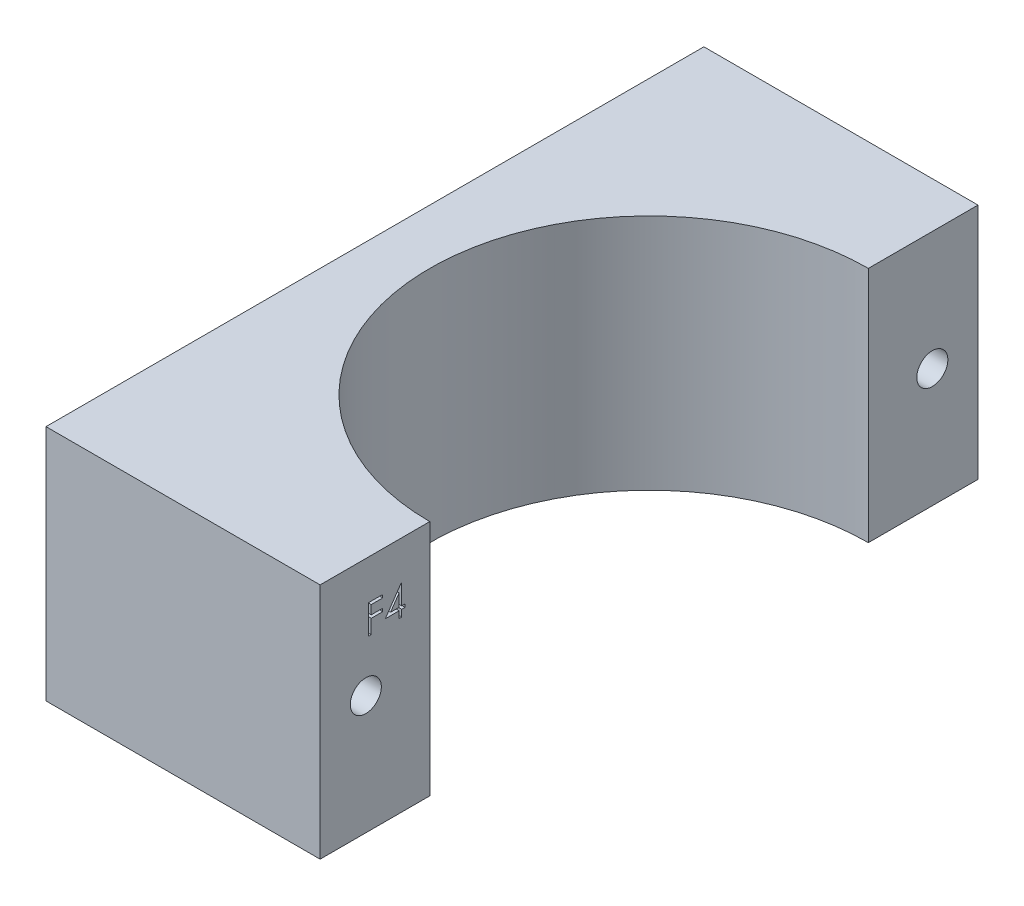
ISO-10303-21;
HEADER;
FILE_DESCRIPTION(('STEP AP214'),'2;1');
FILE_NAME('part.step','',(''),(''),'','','');
FILE_SCHEMA(('AUTOMOTIVE_DESIGN { 1 0 10303 214 1 1 1 1 }'));
ENDSEC;
DATA;
#1=APPLICATION_CONTEXT('core data for automotive mechanical design processes');
#2=APPLICATION_PROTOCOL_DEFINITION('international standard','automotive_design',2000,#1);
#3=PRODUCT_CONTEXT('',#1,'mechanical');
#4=PRODUCT('Part','Part','',(#3));
#5=PRODUCT_RELATED_PRODUCT_CATEGORY('part','',(#4));
#6=PRODUCT_DEFINITION_FORMATION('','',#4);
#7=PRODUCT_DEFINITION_CONTEXT('part definition',#1,'design');
#8=PRODUCT_DEFINITION('design','',#6,#7);
#9=PRODUCT_DEFINITION_SHAPE('','',#8);
#10=(LENGTH_UNIT() NAMED_UNIT(*) SI_UNIT(.MILLI.,.METRE.));
#11=(NAMED_UNIT(*) PLANE_ANGLE_UNIT() SI_UNIT($,.RADIAN.));
#12=(NAMED_UNIT(*) SI_UNIT($,.STERADIAN.) SOLID_ANGLE_UNIT());
#13=UNCERTAINTY_MEASURE_WITH_UNIT(LENGTH_MEASURE(1.E-05),#10,'distance_accuracy_value','');
#14=(GEOMETRIC_REPRESENTATION_CONTEXT(3) GLOBAL_UNCERTAINTY_ASSIGNED_CONTEXT((#13)) GLOBAL_UNIT_ASSIGNED_CONTEXT((#10,
#11,#12)) REPRESENTATION_CONTEXT('',''));
#15=CARTESIAN_POINT('',(0.,0.,0.));
#16=DIRECTION('',(0.,0.,1.));
#17=DIRECTION('',(1.,0.,0.));
#18=AXIS2_PLACEMENT_3D('',#15,#16,#17);
#19=CARTESIAN_POINT('',(-16.9982753010088,26.,39.4714285714286));
#20=DIRECTION('',(-1.,0.,0.));
#21=DIRECTION('',(0.,0.,1.));
#22=AXIS2_PLACEMENT_3D('',#19,#20,#21);
#23=PLANE('',#22);
#24=DIRECTION('',(0.,0.824332768950696,-0.566105543193209));
#25=VECTOR('',#24,1.);
#26=CARTESIAN_POINT('',(-16.9982753010088,19.2225018030725,32.3325004085675));
#27=LINE('',#26,#25);
#28=CARTESIAN_POINT('',(-16.9982753010088,19.2225018030725,32.3325004085675));
#29=VERTEX_POINT('',#28);
#30=CARTESIAN_POINT('',(-16.9982753010088,21.7462197517905,30.5993523717085));
#31=VERTEX_POINT('',#30);
#32=EDGE_CURVE('E67',#29,#31,#27,.T.);
#33=ORIENTED_EDGE('',*,*,#32,.T.);
#34=DIRECTION('',(0.,0.,-1.));
#35=VECTOR('',#34,1.);
#36=CARTESIAN_POINT('',(-16.9982753010088,21.7462197517905,30.5993523717085));
#37=LINE('',#36,#35);
#38=CARTESIAN_POINT('',(-16.9982753010088,21.7462197517905,30.5414747675419));
#39=VERTEX_POINT('',#38);
#40=EDGE_CURVE('E337',#31,#39,#37,.T.);
#41=ORIENTED_EDGE('',*,*,#40,.T.);
#42=DIRECTION('',(0.,-1.,0.));
#43=VECTOR('',#42,1.);
#44=CARTESIAN_POINT('',(-16.9982753010088,21.7462197517905,30.5414747675419));
#45=LINE('',#44,#43);
#46=CARTESIAN_POINT('',(-16.9982753010088,19.5481428287135,30.5414747675419));
#47=VERTEX_POINT('',#46);
#48=EDGE_CURVE('E333',#39,#47,#45,.T.);
#49=ORIENTED_EDGE('',*,*,#48,.T.);
#50=DIRECTION('',(0.,0.,-1.));
#51=VECTOR('',#50,1.);
#52=CARTESIAN_POINT('',(-16.9982753010088,19.5481428287135,30.5414747675419));
#53=LINE('',#52,#51);
#54=CARTESIAN_POINT('',(-16.9982753010088,19.5481428287135,30.1751286136957));
#55=VERTEX_POINT('',#54);
#56=EDGE_CURVE('E329',#47,#55,#53,.T.);
#57=ORIENTED_EDGE('',*,*,#56,.T.);
#58=DIRECTION('',(0.,-1.,0.));
#59=VECTOR('',#58,1.);
#60=CARTESIAN_POINT('',(-16.9982753010088,19.5481428287135,30.1751286136957));
#61=LINE('',#60,#59);
#62=CARTESIAN_POINT('',(-16.9982753010088,19.2225018030725,30.1751286136957));
#63=VERTEX_POINT('',#62);
#64=EDGE_CURVE('E325',#55,#63,#61,.T.);
#65=ORIENTED_EDGE('',*,*,#64,.T.);
#66=DIRECTION('',(0.,0.,1.));
#67=VECTOR('',#66,1.);
#68=CARTESIAN_POINT('',(-16.9982753010088,19.2225018030725,30.1751286136957));
#69=LINE('',#68,#67);
#70=CARTESIAN_POINT('',(-16.9982753010088,19.2225018030725,30.5414747675419));
#71=VERTEX_POINT('',#70);
#72=EDGE_CURVE('E321',#63,#71,#69,.T.);
#73=ORIENTED_EDGE('',*,*,#72,.T.);
#74=DIRECTION('',(0.,-1.,0.));
#75=VECTOR('',#74,1.);
#76=CARTESIAN_POINT('',(-16.9982753010088,19.2225018030725,30.5414747675419));
#77=LINE('',#76,#75);
#78=CARTESIAN_POINT('',(-16.9982753010088,18.4898094953802,30.5414747675419));
#79=VERTEX_POINT('',#78);
#80=EDGE_CURVE('E317',#71,#79,#77,.T.);
#81=ORIENTED_EDGE('',*,*,#80,.T.);
#82=DIRECTION('',(0.,0.,1.));
#83=VECTOR('',#82,1.);
#84=CARTESIAN_POINT('',(-16.9982753010088,18.4898094953802,30.5414747675419));
#85=LINE('',#84,#83);
#86=CARTESIAN_POINT('',(-16.9982753010088,18.4898094953802,30.8264106649778));
#87=VERTEX_POINT('',#86);
#88=EDGE_CURVE('E313',#79,#87,#85,.T.);
#89=ORIENTED_EDGE('',*,*,#88,.T.);
#90=DIRECTION('',(0.,1.,0.));
#91=VECTOR('',#90,1.);
#92=CARTESIAN_POINT('',(-16.9982753010088,18.4898094953802,30.8264106649778));
#93=LINE('',#92,#91);
#94=CARTESIAN_POINT('',(-16.9982753010088,19.2225018030725,30.8264106649778));
#95=VERTEX_POINT('',#94);
#96=EDGE_CURVE('E308',#87,#95,#93,.T.);
#97=ORIENTED_EDGE('',*,*,#96,.T.);
#98=DIRECTION('',(0.,0.,1.));
#99=VECTOR('',#98,1.);
#100=CARTESIAN_POINT('',(-16.9982753010088,19.2225018030725,30.8264106649778));
#101=LINE('',#100,#99);
#102=EDGE_CURVE('E304',#95,#29,#101,.T.);
#103=ORIENTED_EDGE('',*,*,#102,.T.);
#104=EDGE_LOOP('',(#33,#41,#49,#57,#65,#73,#81,#89,#97,#103));
#105=FACE_BOUND('',#104,.T.);
#106=CARTESIAN_POINT('',(-16.9982753010088,13.,34.4714285714286));
#107=DIRECTION('',(1.,0.,0.));
#108=DIRECTION('',(0.,0.,-1.));
#109=AXIS2_PLACEMENT_3D('',#106,#107,#108);
#110=CIRCLE('',#109,1.7);
#111=CARTESIAN_POINT('',(-16.9982753010088,13.,32.7714285714286));
#112=VERTEX_POINT('',#111);
#113=EDGE_CURVE('E411',#112,#112,#110,.T.);
#114=ORIENTED_EDGE('',*,*,#113,.F.);
#115=EDGE_LOOP('',(#114));
#116=FACE_BOUND('',#115,.T.);
#117=DIRECTION('',(0.,0.,-1.));
#118=VECTOR('',#117,1.);
#119=CARTESIAN_POINT('',(-16.9982753010088,0.,39.4714285714286));
#120=LINE('',#119,#118);
#121=CARTESIAN_POINT('',(-16.9982753010088,0.,39.4714285714286));
#122=VERTEX_POINT('',#121);
#123=CARTESIAN_POINT('',(-16.9982753010088,0.,27.4714285714286));
#124=VERTEX_POINT('',#123);
#125=EDGE_CURVE('E448',#122,#124,#120,.T.);
#126=ORIENTED_EDGE('',*,*,#125,.T.);
#127=DIRECTION('',(0.,-1.,0.));
#128=VECTOR('',#127,1.);
#129=CARTESIAN_POINT('',(-16.9982753010088,26.,27.4714285714286));
#130=LINE('',#129,#128);
#131=CARTESIAN_POINT('',(-16.9982753010088,26.,27.4714285714286));
#132=VERTEX_POINT('',#131);
#133=EDGE_CURVE('E463',#132,#124,#130,.T.);
#134=ORIENTED_EDGE('',*,*,#133,.F.);
#135=DIRECTION('',(0.,0.,-1.));
#136=VECTOR('',#135,1.);
#137=CARTESIAN_POINT('',(-16.9982753010088,26.,39.4714285714286));
#138=LINE('',#137,#136);
#139=CARTESIAN_POINT('',(-16.9982753010088,26.,39.4714285714286));
#140=VERTEX_POINT('',#139);
#141=EDGE_CURVE('E429',#140,#132,#138,.T.);
#142=ORIENTED_EDGE('',*,*,#141,.F.);
#143=DIRECTION('',(0.,-1.,0.));
#144=VECTOR('',#143,1.);
#145=CARTESIAN_POINT('',(-16.9982753010088,26.,39.4714285714286));
#146=LINE('',#145,#144);
#147=EDGE_CURVE('E467',#140,#122,#146,.T.);
#148=ORIENTED_EDGE('',*,*,#147,.T.);
#149=EDGE_LOOP('',(#126,#134,#142,#148));
#150=FACE_BOUND('',#149,.T.);
#151=DIRECTION('',(0.,1.,0.));
#152=VECTOR('',#151,1.);
#153=CARTESIAN_POINT('',(-16.9982753010088,18.4898094953802,34.1642311777983));
#154=LINE('',#153,#152);
#155=CARTESIAN_POINT('',(-16.9982753010088,18.4898094953802,34.1642311777983));
#156=VERTEX_POINT('',#155);
#157=CARTESIAN_POINT('',(-16.9982753010088,21.6648094953802,34.1642311777983));
#158=VERTEX_POINT('',#157);
#159=EDGE_CURVE('E59',#156,#158,#154,.T.);
#160=ORIENTED_EDGE('',*,*,#159,.T.);
#161=DIRECTION('',(0.,0.,-1.));
#162=VECTOR('',#161,1.);
#163=CARTESIAN_POINT('',(-16.9982753010088,21.6648094953802,34.1642311777983));
#164=LINE('',#163,#162);
#165=CARTESIAN_POINT('',(-16.9982753010088,21.6648094953802,32.6174363060034));
#166=VERTEX_POINT('',#165);
#167=EDGE_CURVE('E259',#158,#166,#164,.T.);
#168=ORIENTED_EDGE('',*,*,#167,.T.);
#169=DIRECTION('',(0.,-1.,0.));
#170=VECTOR('',#169,1.);
#171=CARTESIAN_POINT('',(-16.9982753010088,21.6648094953802,32.6174363060034));
#172=LINE('',#171,#170);
#173=CARTESIAN_POINT('',(-16.9982753010088,21.3391684697392,32.6174363060034));
#174=VERTEX_POINT('',#173);
#175=EDGE_CURVE('E997',#166,#174,#172,.T.);
#176=ORIENTED_EDGE('',*,*,#175,.T.);
#177=DIRECTION('',(0.,0.,1.));
#178=VECTOR('',#177,1.);
#179=CARTESIAN_POINT('',(-16.9982753010088,21.3391684697392,32.6174363060034));
#180=LINE('',#179,#178);
#181=CARTESIAN_POINT('',(-16.9982753010088,21.3391684697392,33.8792952803624));
#182=VERTEX_POINT('',#181);
#183=EDGE_CURVE('E999',#174,#182,#180,.T.);
#184=ORIENTED_EDGE('',*,*,#183,.T.);
#185=DIRECTION('',(0.,-1.,0.));
#186=VECTOR('',#185,1.);
#187=CARTESIAN_POINT('',(-16.9982753010088,21.3391684697392,33.8792952803624));
#188=LINE('',#187,#186);
#189=CARTESIAN_POINT('',(-16.9982753010088,20.3622453928161,33.8792952803624));
#190=VERTEX_POINT('',#189);
#191=EDGE_CURVE('E1004',#182,#190,#188,.T.);
#192=ORIENTED_EDGE('',*,*,#191,.T.);
#193=DIRECTION('',(0.,0.,-1.));
#194=VECTOR('',#193,1.);
#195=CARTESIAN_POINT('',(-16.9982753010088,20.3622453928161,33.8792952803624));
#196=LINE('',#195,#194);
#197=CARTESIAN_POINT('',(-16.9982753010088,20.3622453928161,32.6174363060034));
#198=VERTEX_POINT('',#197);
#199=EDGE_CURVE('E1014',#190,#198,#196,.T.);
#200=ORIENTED_EDGE('',*,*,#199,.T.);
#201=DIRECTION('',(0.,-1.,0.));
#202=VECTOR('',#201,1.);
#203=CARTESIAN_POINT('',(-16.9982753010088,20.3622453928161,32.6174363060034));
#204=LINE('',#203,#202);
#205=CARTESIAN_POINT('',(-16.9982753010088,20.0366043671751,32.6174363060034));
#206=VERTEX_POINT('',#205);
#207=EDGE_CURVE('E969',#198,#206,#204,.T.);
#208=ORIENTED_EDGE('',*,*,#207,.T.);
#209=DIRECTION('',(0.,0.,1.));
#210=VECTOR('',#209,1.);
#211=CARTESIAN_POINT('',(-16.9982753010088,20.0366043671751,32.6174363060034));
#212=LINE('',#211,#210);
#213=CARTESIAN_POINT('',(-16.9982753010088,20.0366043671751,33.8792952803624));
#214=VERTEX_POINT('',#213);
#215=EDGE_CURVE('E964',#206,#214,#212,.T.);
#216=ORIENTED_EDGE('',*,*,#215,.T.);
#217=DIRECTION('',(0.,-1.,0.));
#218=VECTOR('',#217,1.);
#219=CARTESIAN_POINT('',(-16.9982753010088,20.0366043671751,33.8792952803624));
#220=LINE('',#219,#218);
#221=CARTESIAN_POINT('',(-16.9982753010088,18.4898094953802,33.8792952803624));
#222=VERTEX_POINT('',#221);
#223=EDGE_CURVE('E958',#214,#222,#220,.T.);
#224=ORIENTED_EDGE('',*,*,#223,.T.);
#225=DIRECTION('',(0.,0.,1.));
#226=VECTOR('',#225,1.);
#227=CARTESIAN_POINT('',(-16.9982753010088,18.4898094953802,33.8792952803624));
#228=LINE('',#227,#226);
#229=EDGE_CURVE('E255',#222,#156,#228,.T.);
#230=ORIENTED_EDGE('',*,*,#229,.T.);
#231=EDGE_LOOP('',(#160,#168,#176,#184,#192,#200,#208,#216,#224,#230));
#232=FACE_BOUND('',#231,.T.);
#233=ADVANCED_FACE('F43',(#105,#116,#150,#232),#23,.F.);
#234=CARTESIAN_POINT('',(-46.9982753010088,26.,-32.5285714285714));
#235=DIRECTION('',(0.,0.,1.));
#236=DIRECTION('',(1.,0.,0.));
#237=AXIS2_PLACEMENT_3D('',#234,#235,#236);
#238=PLANE('',#237);
#239=DIRECTION('',(-1.,0.,0.));
#240=VECTOR('',#239,1.);
#241=CARTESIAN_POINT('',(-46.9982753010088,0.,-32.5285714285714));
#242=LINE('',#241,#240);
#243=CARTESIAN_POINT('',(-16.9982753010088,0.,-32.5285714285714));
#244=VERTEX_POINT('',#243);
#245=CARTESIAN_POINT('',(-46.9982753010088,0.,-32.5285714285714));
#246=VERTEX_POINT('',#245);
#247=EDGE_CURVE('E410',#244,#246,#242,.T.);
#248=ORIENTED_EDGE('',*,*,#247,.T.);
#249=DIRECTION('',(0.,-1.,0.));
#250=VECTOR('',#249,1.);
#251=CARTESIAN_POINT('',(-46.9982753010088,26.,-32.5285714285714));
#252=LINE('',#251,#250);
#253=CARTESIAN_POINT('',(-46.9982753010088,26.,-32.5285714285714));
#254=VERTEX_POINT('',#253);
#255=EDGE_CURVE('E11',#254,#246,#252,.T.);
#256=ORIENTED_EDGE('',*,*,#255,.F.);
#257=DIRECTION('',(-1.,0.,0.));
#258=VECTOR('',#257,1.);
#259=CARTESIAN_POINT('',(-46.9982753010088,26.,-32.5285714285714));
#260=LINE('',#259,#258);
#261=CARTESIAN_POINT('',(-16.9982753010088,26.,-32.5285714285714));
#262=VERTEX_POINT('',#261);
#263=EDGE_CURVE('E418',#262,#254,#260,.T.);
#264=ORIENTED_EDGE('',*,*,#263,.F.);
#265=DIRECTION('',(0.,-1.,0.));
#266=VECTOR('',#265,1.);
#267=CARTESIAN_POINT('',(-16.9982753010088,26.,-32.5285714285714));
#268=LINE('',#267,#266);
#269=EDGE_CURVE('E438',#262,#244,#268,.T.);
#270=ORIENTED_EDGE('',*,*,#269,.T.);
#271=EDGE_LOOP('',(#248,#256,#264,#270));
#272=FACE_BOUND('',#271,.T.);
#273=ADVANCED_FACE('F45',(#272),#238,.F.);
#274=CARTESIAN_POINT('',(-46.9982753010088,26.,-32.5285714285714));
#275=DIRECTION('',(1.,0.,0.));
#276=DIRECTION('',(0.,0.,-1.));
#277=AXIS2_PLACEMENT_3D('',#274,#275,#276);
#278=PLANE('',#277);
#279=CARTESIAN_POINT('',(-46.9982753010088,13.,34.4714285714286));
#280=DIRECTION('',(1.,0.,0.));
#281=DIRECTION('',(0.,0.,-1.));
#282=AXIS2_PLACEMENT_3D('',#279,#280,#281);
#283=CIRCLE('',#282,1.7);
#284=CARTESIAN_POINT('',(-46.9982753010088,13.,32.7714285714286));
#285=VERTEX_POINT('',#284);
#286=EDGE_CURVE('E406',#285,#285,#283,.T.);
#287=ORIENTED_EDGE('',*,*,#286,.T.);
#288=EDGE_LOOP('',(#287));
#289=FACE_BOUND('',#288,.T.);
#290=CARTESIAN_POINT('',(-46.9982753010088,13.,-27.5285714285714));
#291=DIRECTION('',(1.,0.,0.));
#292=DIRECTION('',(0.,0.,-1.));
#293=AXIS2_PLACEMENT_3D('',#290,#291,#292);
#294=CIRCLE('',#293,1.7);
#295=CARTESIAN_POINT('',(-46.9982753010088,13.,-29.2285714285714));
#296=VERTEX_POINT('',#295);
#297=EDGE_CURVE('E261',#296,#296,#294,.T.);
#298=ORIENTED_EDGE('',*,*,#297,.T.);
#299=EDGE_LOOP('',(#298));
#300=FACE_BOUND('',#299,.T.);
#301=DIRECTION('',(0.,0.,1.));
#302=VECTOR('',#301,1.);
#303=CARTESIAN_POINT('',(-46.9982753010088,0.,-32.5285714285714));
#304=LINE('',#303,#302);
#305=CARTESIAN_POINT('',(-46.9982753010088,0.,39.4714285714286));
#306=VERTEX_POINT('',#305);
#307=EDGE_CURVE('E442',#246,#306,#304,.T.);
#308=ORIENTED_EDGE('',*,*,#307,.T.);
#309=DIRECTION('',(0.,-1.,0.));
#310=VECTOR('',#309,1.);
#311=CARTESIAN_POINT('',(-46.9982753010088,26.,39.4714285714286));
#312=LINE('',#311,#310);
#313=CARTESIAN_POINT('',(-46.9982753010088,26.,39.4714285714286));
#314=VERTEX_POINT('',#313);
#315=EDGE_CURVE('E52',#314,#306,#312,.T.);
#316=ORIENTED_EDGE('',*,*,#315,.F.);
#317=DIRECTION('',(0.,0.,1.));
#318=VECTOR('',#317,1.);
#319=CARTESIAN_POINT('',(-46.9982753010088,26.,-32.5285714285714));
#320=LINE('',#319,#318);
#321=EDGE_CURVE('E422',#254,#314,#320,.T.);
#322=ORIENTED_EDGE('',*,*,#321,.F.);
#323=ORIENTED_EDGE('',*,*,#255,.T.);
#324=EDGE_LOOP('',(#308,#316,#322,#323));
#325=FACE_BOUND('',#324,.T.);
#326=ADVANCED_FACE('F499',(#289,#300,#325),#278,.F.);
#327=CARTESIAN_POINT('',(-46.9982753010088,26.,39.4714285714286));
#328=DIRECTION('',(0.,0.,-1.));
#329=DIRECTION('',(-1.,0.,0.));
#330=AXIS2_PLACEMENT_3D('',#327,#328,#329);
#331=PLANE('',#330);
#332=DIRECTION('',(1.,0.,0.));
#333=VECTOR('',#332,1.);
#334=CARTESIAN_POINT('',(-46.9982753010088,0.,39.4714285714286));
#335=LINE('',#334,#333);
#336=EDGE_CURVE('E445',#306,#122,#335,.T.);
#337=ORIENTED_EDGE('',*,*,#336,.T.);
#338=ORIENTED_EDGE('',*,*,#147,.F.);
#339=DIRECTION('',(1.,0.,0.));
#340=VECTOR('',#339,1.);
#341=CARTESIAN_POINT('',(-46.9982753010088,26.,39.4714285714286));
#342=LINE('',#341,#340);
#343=EDGE_CURVE('E426',#314,#140,#342,.T.);
#344=ORIENTED_EDGE('',*,*,#343,.F.);
#345=ORIENTED_EDGE('',*,*,#315,.T.);
#346=EDGE_LOOP('',(#337,#338,#344,#345));
#347=FACE_BOUND('',#346,.T.);
#348=ADVANCED_FACE('F476',(#347),#331,.F.);
#349=CARTESIAN_POINT('',(-16.9982753010088,26.,3.47142857142857));
#350=DIRECTION('',(0.,-1.,0.));
#351=DIRECTION('',(0.,0.,-1.));
#352=AXIS2_PLACEMENT_3D('',#349,#350,#351);
#353=CYLINDRICAL_SURFACE('',#352,24.);
#354=CARTESIAN_POINT('',(-16.9982753010088,0.,3.47142857142857));
#355=DIRECTION('',(0.,-1.,0.));
#356=DIRECTION('',(0.,0.,1.));
#357=AXIS2_PLACEMENT_3D('',#354,#355,#356);
#358=CIRCLE('',#357,24.);
#359=CARTESIAN_POINT('',(-16.9982753010088,0.,-20.5285714285714));
#360=VERTEX_POINT('',#359);
#361=EDGE_CURVE('E451',#124,#360,#358,.T.);
#362=ORIENTED_EDGE('',*,*,#361,.T.);
#363=DIRECTION('',(0.,-1.,0.));
#364=VECTOR('',#363,1.);
#365=CARTESIAN_POINT('',(-16.9982753010088,26.,-20.5285714285714));
#366=LINE('',#365,#364);
#367=CARTESIAN_POINT('',(-16.9982753010088,26.,-20.5285714285714));
#368=VERTEX_POINT('',#367);
#369=EDGE_CURVE('E459',#368,#360,#366,.T.);
#370=ORIENTED_EDGE('',*,*,#369,.F.);
#371=CARTESIAN_POINT('',(-16.9982753010088,26.,3.47142857142857));
#372=DIRECTION('',(0.,-1.,0.));
#373=DIRECTION('',(0.,0.,1.));
#374=AXIS2_PLACEMENT_3D('',#371,#372,#373);
#375=CIRCLE('',#374,24.);
#376=EDGE_CURVE('E432',#132,#368,#375,.T.);
#377=ORIENTED_EDGE('',*,*,#376,.F.);
#378=ORIENTED_EDGE('',*,*,#133,.T.);
#379=EDGE_LOOP('',(#362,#370,#377,#378));
#380=FACE_BOUND('',#379,.T.);
#381=ADVANCED_FACE('F491',(#380),#353,.F.);
#382=CARTESIAN_POINT('',(-16.9982753010088,26.,-32.5285714285714));
#383=DIRECTION('',(-1.,0.,0.));
#384=DIRECTION('',(0.,0.,1.));
#385=AXIS2_PLACEMENT_3D('',#382,#383,#384);
#386=PLANE('',#385);
#387=CARTESIAN_POINT('',(-16.9982753010088,13.,-27.5285714285714));
#388=DIRECTION('',(1.,0.,0.));
#389=DIRECTION('',(0.,0.,-1.));
#390=AXIS2_PLACEMENT_3D('',#387,#388,#389);
#391=CIRCLE('',#390,1.7);
#392=CARTESIAN_POINT('',(-16.9982753010088,13.,-29.2285714285714));
#393=VERTEX_POINT('',#392);
#394=EDGE_CURVE('E267',#393,#393,#391,.T.);
#395=ORIENTED_EDGE('',*,*,#394,.F.);
#396=EDGE_LOOP('',(#395));
#397=FACE_BOUND('',#396,.T.);
#398=DIRECTION('',(0.,0.,-1.));
#399=VECTOR('',#398,1.);
#400=CARTESIAN_POINT('',(-16.9982753010088,0.,-32.5285714285714));
#401=LINE('',#400,#399);
#402=EDGE_CURVE('E423',#360,#244,#401,.T.);
#403=ORIENTED_EDGE('',*,*,#402,.T.);
#404=ORIENTED_EDGE('',*,*,#269,.F.);
#405=DIRECTION('',(0.,0.,-1.));
#406=VECTOR('',#405,1.);
#407=CARTESIAN_POINT('',(-16.9982753010088,26.,-32.5285714285714));
#408=LINE('',#407,#406);
#409=EDGE_CURVE('E435',#368,#262,#408,.T.);
#410=ORIENTED_EDGE('',*,*,#409,.F.);
#411=ORIENTED_EDGE('',*,*,#369,.T.);
#412=EDGE_LOOP('',(#403,#404,#410,#411));
#413=FACE_BOUND('',#412,.T.);
#414=ADVANCED_FACE('F502',(#397,#413),#386,.F.);
#415=CARTESIAN_POINT('',(-16.9982753010088,26.,3.47142857142857));
#416=DIRECTION('',(0.,1.,0.));
#417=DIRECTION('',(0.,0.,1.));
#418=AXIS2_PLACEMENT_3D('',#415,#416,#417);
#419=PLANE('',#418);
#420=ORIENTED_EDGE('',*,*,#263,.T.);
#421=ORIENTED_EDGE('',*,*,#321,.T.);
#422=ORIENTED_EDGE('',*,*,#343,.T.);
#423=ORIENTED_EDGE('',*,*,#141,.T.);
#424=ORIENTED_EDGE('',*,*,#376,.T.);
#425=ORIENTED_EDGE('',*,*,#409,.T.);
#426=EDGE_LOOP('',(#420,#421,#422,#423,#424,#425));
#427=FACE_BOUND('',#426,.T.);
#428=ADVANCED_FACE('F495',(#427),#419,.T.);
#429=CARTESIAN_POINT('',(-16.9982753010088,0.,3.47142857142857));
#430=DIRECTION('',(0.,1.,0.));
#431=DIRECTION('',(0.,0.,1.));
#432=AXIS2_PLACEMENT_3D('',#429,#430,#431);
#433=PLANE('',#432);
#434=ORIENTED_EDGE('',*,*,#247,.F.);
#435=ORIENTED_EDGE('',*,*,#402,.F.);
#436=ORIENTED_EDGE('',*,*,#361,.F.);
#437=ORIENTED_EDGE('',*,*,#125,.F.);
#438=ORIENTED_EDGE('',*,*,#336,.F.);
#439=ORIENTED_EDGE('',*,*,#307,.F.);
#440=EDGE_LOOP('',(#434,#435,#436,#437,#438,#439));
#441=FACE_BOUND('',#440,.T.);
#442=ADVANCED_FACE('F482',(#441),#433,.F.);
#443=CARTESIAN_POINT('',(-46.9982753010088,13.,-27.5285714285714));
#444=DIRECTION('',(1.,0.,0.));
#445=DIRECTION('',(0.,0.,-1.));
#446=AXIS2_PLACEMENT_3D('',#443,#444,#445);
#447=CYLINDRICAL_SURFACE('',#446,1.7);
#448=ORIENTED_EDGE('',*,*,#297,.F.);
#449=EDGE_LOOP('',(#448));
#450=FACE_BOUND('',#449,.T.);
#451=ORIENTED_EDGE('',*,*,#394,.T.);
#452=EDGE_LOOP('',(#451));
#453=FACE_BOUND('',#452,.T.);
#454=ADVANCED_FACE('F622',(#450,#453),#447,.F.);
#455=CARTESIAN_POINT('',(-46.9982753010088,13.,34.4714285714286));
#456=DIRECTION('',(1.,0.,0.));
#457=DIRECTION('',(0.,0.,-1.));
#458=AXIS2_PLACEMENT_3D('',#455,#456,#457);
#459=CYLINDRICAL_SURFACE('',#458,1.7);
#460=ORIENTED_EDGE('',*,*,#286,.F.);
#461=EDGE_LOOP('',(#460));
#462=FACE_BOUND('',#461,.T.);
#463=ORIENTED_EDGE('',*,*,#113,.T.);
#464=EDGE_LOOP('',(#463));
#465=FACE_BOUND('',#464,.T.);
#466=ADVANCED_FACE('F619',(#462,#465),#459,.F.);
#467=CARTESIAN_POINT('',(-17.9982753010088,19.2225018030725,32.3325004085675));
#468=DIRECTION('',(0.,-0.566105543193209,-0.824332768950696));
#469=DIRECTION('',(0.,0.824332768950696,-0.566105543193209));
#470=AXIS2_PLACEMENT_3D('',#467,#468,#469);
#471=PLANE('',#470);
#472=ORIENTED_EDGE('',*,*,#32,.F.);
#473=DIRECTION('',(1.,0.,0.));
#474=VECTOR('',#473,1.);
#475=CARTESIAN_POINT('',(-17.9982753010088,19.2225018030725,32.3325004085675));
#476=LINE('',#475,#474);
#477=CARTESIAN_POINT('',(-17.9982753010088,19.2225018030725,32.3325004085675));
#478=VERTEX_POINT('',#477);
#479=EDGE_CURVE('E300',#478,#29,#476,.T.);
#480=ORIENTED_EDGE('',*,*,#479,.F.);
#481=DIRECTION('',(0.,0.824332768950696,-0.566105543193209));
#482=VECTOR('',#481,1.);
#483=CARTESIAN_POINT('',(-17.9982753010088,19.2225018030725,32.3325004085675));
#484=LINE('',#483,#482);
#485=CARTESIAN_POINT('',(-17.9982753010088,21.7462197517905,30.5993523717085));
#486=VERTEX_POINT('',#485);
#487=EDGE_CURVE('E309',#478,#486,#484,.T.);
#488=ORIENTED_EDGE('',*,*,#487,.T.);
#489=DIRECTION('',(1.,0.,0.));
#490=VECTOR('',#489,1.);
#491=CARTESIAN_POINT('',(-17.9982753010088,21.7462197517905,30.5993523717085));
#492=LINE('',#491,#490);
#493=EDGE_CURVE('E273',#486,#31,#492,.T.);
#494=ORIENTED_EDGE('',*,*,#493,.T.);
#495=EDGE_LOOP('',(#472,#480,#488,#494));
#496=FACE_BOUND('',#495,.T.);
#497=ADVANCED_FACE('F552',(#496),#471,.T.);
#498=CARTESIAN_POINT('',(-17.9982753010088,21.7462197517905,30.5993523717085));
#499=DIRECTION('',(0.,-1.,0.));
#500=DIRECTION('',(0.,0.,-1.));
#501=AXIS2_PLACEMENT_3D('',#498,#499,#500);
#502=PLANE('',#501);
#503=ORIENTED_EDGE('',*,*,#40,.F.);
#504=ORIENTED_EDGE('',*,*,#493,.F.);
#505=DIRECTION('',(0.,0.,-1.));
#506=VECTOR('',#505,1.);
#507=CARTESIAN_POINT('',(-17.9982753010088,21.7462197517905,30.5993523717085));
#508=LINE('',#507,#506);
#509=CARTESIAN_POINT('',(-17.9982753010088,21.7462197517905,30.5414747675419));
#510=VERTEX_POINT('',#509);
#511=EDGE_CURVE('E367',#486,#510,#508,.T.);
#512=ORIENTED_EDGE('',*,*,#511,.T.);
#513=DIRECTION('',(1.,0.,0.));
#514=VECTOR('',#513,1.);
#515=CARTESIAN_POINT('',(-17.9982753010088,21.7462197517905,30.5414747675419));
#516=LINE('',#515,#514);
#517=EDGE_CURVE('E276',#510,#39,#516,.T.);
#518=ORIENTED_EDGE('',*,*,#517,.T.);
#519=EDGE_LOOP('',(#503,#504,#512,#518));
#520=FACE_BOUND('',#519,.T.);
#521=ADVANCED_FACE('F554',(#520),#502,.T.);
#522=CARTESIAN_POINT('',(-17.9982753010088,21.7462197517905,30.5414747675419));
#523=DIRECTION('',(0.,0.,1.));
#524=DIRECTION('',(1.,0.,0.));
#525=AXIS2_PLACEMENT_3D('',#522,#523,#524);
#526=PLANE('',#525);
#527=ORIENTED_EDGE('',*,*,#48,.F.);
#528=ORIENTED_EDGE('',*,*,#517,.F.);
#529=DIRECTION('',(0.,-1.,0.));
#530=VECTOR('',#529,1.);
#531=CARTESIAN_POINT('',(-17.9982753010088,21.7462197517905,30.5414747675419));
#532=LINE('',#531,#530);
#533=CARTESIAN_POINT('',(-17.9982753010088,19.5481428287135,30.5414747675419));
#534=VERTEX_POINT('',#533);
#535=EDGE_CURVE('E364',#510,#534,#532,.T.);
#536=ORIENTED_EDGE('',*,*,#535,.T.);
#537=DIRECTION('',(1.,0.,0.));
#538=VECTOR('',#537,1.);
#539=CARTESIAN_POINT('',(-17.9982753010088,19.5481428287135,30.5414747675419));
#540=LINE('',#539,#538);
#541=EDGE_CURVE('E279',#534,#47,#540,.T.);
#542=ORIENTED_EDGE('',*,*,#541,.T.);
#543=EDGE_LOOP('',(#527,#528,#536,#542));
#544=FACE_BOUND('',#543,.T.);
#545=ADVANCED_FACE('F590',(#544),#526,.T.);
#546=CARTESIAN_POINT('',(-17.9982753010088,19.5481428287135,30.5414747675419));
#547=DIRECTION('',(0.,-1.,0.));
#548=DIRECTION('',(0.,0.,-1.));
#549=AXIS2_PLACEMENT_3D('',#546,#547,#548);
#550=PLANE('',#549);
#551=ORIENTED_EDGE('',*,*,#56,.F.);
#552=ORIENTED_EDGE('',*,*,#541,.F.);
#553=DIRECTION('',(0.,0.,-1.));
#554=VECTOR('',#553,1.);
#555=CARTESIAN_POINT('',(-17.9982753010088,19.5481428287135,30.5414747675419));
#556=LINE('',#555,#554);
#557=CARTESIAN_POINT('',(-17.9982753010088,19.5481428287135,30.1751286136957));
#558=VERTEX_POINT('',#557);
#559=EDGE_CURVE('E361',#534,#558,#556,.T.);
#560=ORIENTED_EDGE('',*,*,#559,.T.);
#561=DIRECTION('',(1.,0.,0.));
#562=VECTOR('',#561,1.);
#563=CARTESIAN_POINT('',(-17.9982753010088,19.5481428287135,30.1751286136957));
#564=LINE('',#563,#562);
#565=EDGE_CURVE('E282',#558,#55,#564,.T.);
#566=ORIENTED_EDGE('',*,*,#565,.T.);
#567=EDGE_LOOP('',(#551,#552,#560,#566));
#568=FACE_BOUND('',#567,.T.);
#569=ADVANCED_FACE('F587',(#568),#550,.T.);
#570=CARTESIAN_POINT('',(-17.9982753010088,19.5481428287135,30.1751286136957));
#571=DIRECTION('',(0.,0.,1.));
#572=DIRECTION('',(1.,0.,0.));
#573=AXIS2_PLACEMENT_3D('',#570,#571,#572);
#574=PLANE('',#573);
#575=ORIENTED_EDGE('',*,*,#64,.F.);
#576=ORIENTED_EDGE('',*,*,#565,.F.);
#577=DIRECTION('',(0.,-1.,0.));
#578=VECTOR('',#577,1.);
#579=CARTESIAN_POINT('',(-17.9982753010088,19.5481428287135,30.1751286136957));
#580=LINE('',#579,#578);
#581=CARTESIAN_POINT('',(-17.9982753010088,19.2225018030725,30.1751286136957));
#582=VERTEX_POINT('',#581);
#583=EDGE_CURVE('E358',#558,#582,#580,.T.);
#584=ORIENTED_EDGE('',*,*,#583,.T.);
#585=DIRECTION('',(1.,0.,0.));
#586=VECTOR('',#585,1.);
#587=CARTESIAN_POINT('',(-17.9982753010088,19.2225018030725,30.1751286136957));
#588=LINE('',#587,#586);
#589=EDGE_CURVE('E285',#582,#63,#588,.T.);
#590=ORIENTED_EDGE('',*,*,#589,.T.);
#591=EDGE_LOOP('',(#575,#576,#584,#590));
#592=FACE_BOUND('',#591,.T.);
#593=ADVANCED_FACE('F584',(#592),#574,.T.);
#594=CARTESIAN_POINT('',(-17.9982753010088,19.2225018030725,30.1751286136957));
#595=DIRECTION('',(0.,1.,0.));
#596=DIRECTION('',(0.,0.,1.));
#597=AXIS2_PLACEMENT_3D('',#594,#595,#596);
#598=PLANE('',#597);
#599=ORIENTED_EDGE('',*,*,#72,.F.);
#600=ORIENTED_EDGE('',*,*,#589,.F.);
#601=DIRECTION('',(0.,0.,1.));
#602=VECTOR('',#601,1.);
#603=CARTESIAN_POINT('',(-17.9982753010088,19.2225018030725,30.1751286136957));
#604=LINE('',#603,#602);
#605=CARTESIAN_POINT('',(-17.9982753010088,19.2225018030725,30.5414747675419));
#606=VERTEX_POINT('',#605);
#607=EDGE_CURVE('E355',#582,#606,#604,.T.);
#608=ORIENTED_EDGE('',*,*,#607,.T.);
#609=DIRECTION('',(1.,0.,0.));
#610=VECTOR('',#609,1.);
#611=CARTESIAN_POINT('',(-17.9982753010088,19.2225018030725,30.5414747675419));
#612=LINE('',#611,#610);
#613=EDGE_CURVE('E288',#606,#71,#612,.T.);
#614=ORIENTED_EDGE('',*,*,#613,.T.);
#615=EDGE_LOOP('',(#599,#600,#608,#614));
#616=FACE_BOUND('',#615,.T.);
#617=ADVANCED_FACE('F577',(#616),#598,.T.);
#618=CARTESIAN_POINT('',(-17.9982753010088,19.2225018030725,30.5414747675419));
#619=DIRECTION('',(0.,0.,1.));
#620=DIRECTION('',(1.,0.,0.));
#621=AXIS2_PLACEMENT_3D('',#618,#619,#620);
#622=PLANE('',#621);
#623=ORIENTED_EDGE('',*,*,#80,.F.);
#624=ORIENTED_EDGE('',*,*,#613,.F.);
#625=DIRECTION('',(0.,-1.,0.));
#626=VECTOR('',#625,1.);
#627=CARTESIAN_POINT('',(-17.9982753010088,19.2225018030725,30.5414747675419));
#628=LINE('',#627,#626);
#629=CARTESIAN_POINT('',(-17.9982753010088,18.4898094953802,30.5414747675419));
#630=VERTEX_POINT('',#629);
#631=EDGE_CURVE('E352',#606,#630,#628,.T.);
#632=ORIENTED_EDGE('',*,*,#631,.T.);
#633=DIRECTION('',(1.,0.,0.));
#634=VECTOR('',#633,1.);
#635=CARTESIAN_POINT('',(-17.9982753010088,18.4898094953802,30.5414747675419));
#636=LINE('',#635,#634);
#637=EDGE_CURVE('E291',#630,#79,#636,.T.);
#638=ORIENTED_EDGE('',*,*,#637,.T.);
#639=EDGE_LOOP('',(#623,#624,#632,#638));
#640=FACE_BOUND('',#639,.T.);
#641=ADVANCED_FACE('F573',(#640),#622,.T.);
#642=CARTESIAN_POINT('',(-17.9982753010088,18.4898094953802,30.5414747675419));
#643=DIRECTION('',(0.,1.,0.));
#644=DIRECTION('',(0.,0.,1.));
#645=AXIS2_PLACEMENT_3D('',#642,#643,#644);
#646=PLANE('',#645);
#647=ORIENTED_EDGE('',*,*,#88,.F.);
#648=ORIENTED_EDGE('',*,*,#637,.F.);
#649=DIRECTION('',(0.,0.,1.));
#650=VECTOR('',#649,1.);
#651=CARTESIAN_POINT('',(-17.9982753010088,18.4898094953802,30.5414747675419));
#652=LINE('',#651,#650);
#653=CARTESIAN_POINT('',(-17.9982753010088,18.4898094953802,30.8264106649778));
#654=VERTEX_POINT('',#653);
#655=EDGE_CURVE('E349',#630,#654,#652,.T.);
#656=ORIENTED_EDGE('',*,*,#655,.T.);
#657=DIRECTION('',(1.,0.,0.));
#658=VECTOR('',#657,1.);
#659=CARTESIAN_POINT('',(-17.9982753010088,18.4898094953802,30.8264106649778));
#660=LINE('',#659,#658);
#661=EDGE_CURVE('E294',#654,#87,#660,.T.);
#662=ORIENTED_EDGE('',*,*,#661,.T.);
#663=EDGE_LOOP('',(#647,#648,#656,#662));
#664=FACE_BOUND('',#663,.T.);
#665=ADVANCED_FACE('F570',(#664),#646,.T.);
#666=CARTESIAN_POINT('',(-17.9982753010088,18.4898094953802,30.8264106649778));
#667=DIRECTION('',(0.,0.,-1.));
#668=DIRECTION('',(-1.,0.,0.));
#669=AXIS2_PLACEMENT_3D('',#666,#667,#668);
#670=PLANE('',#669);
#671=ORIENTED_EDGE('',*,*,#96,.F.);
#672=ORIENTED_EDGE('',*,*,#661,.F.);
#673=DIRECTION('',(0.,1.,0.));
#674=VECTOR('',#673,1.);
#675=CARTESIAN_POINT('',(-17.9982753010088,18.4898094953802,30.8264106649778));
#676=LINE('',#675,#674);
#677=CARTESIAN_POINT('',(-17.9982753010088,19.2225018030725,30.8264106649778));
#678=VERTEX_POINT('',#677);
#679=EDGE_CURVE('E346',#654,#678,#676,.T.);
#680=ORIENTED_EDGE('',*,*,#679,.T.);
#681=DIRECTION('',(1.,0.,0.));
#682=VECTOR('',#681,1.);
#683=CARTESIAN_POINT('',(-17.9982753010088,19.2225018030725,30.8264106649778));
#684=LINE('',#683,#682);
#685=EDGE_CURVE('E297',#678,#95,#684,.T.);
#686=ORIENTED_EDGE('',*,*,#685,.T.);
#687=EDGE_LOOP('',(#671,#672,#680,#686));
#688=FACE_BOUND('',#687,.T.);
#689=ADVANCED_FACE('F562',(#688),#670,.T.);
#690=CARTESIAN_POINT('',(-17.9982753010088,19.2225018030725,30.8264106649778));
#691=DIRECTION('',(0.,1.,0.));
#692=DIRECTION('',(0.,0.,1.));
#693=AXIS2_PLACEMENT_3D('',#690,#691,#692);
#694=PLANE('',#693);
#695=ORIENTED_EDGE('',*,*,#102,.F.);
#696=ORIENTED_EDGE('',*,*,#685,.F.);
#697=DIRECTION('',(0.,0.,1.));
#698=VECTOR('',#697,1.);
#699=CARTESIAN_POINT('',(-17.9982753010088,19.2225018030725,30.8264106649778));
#700=LINE('',#699,#698);
#701=EDGE_CURVE('E303',#678,#478,#700,.T.);
#702=ORIENTED_EDGE('',*,*,#701,.T.);
#703=ORIENTED_EDGE('',*,*,#479,.T.);
#704=EDGE_LOOP('',(#695,#696,#702,#703));
#705=FACE_BOUND('',#704,.T.);
#706=ADVANCED_FACE('F545',(#705),#694,.T.);
#707=CARTESIAN_POINT('',(-17.9982753010088,0.,0.));
#708=DIRECTION('',(-1.,0.,0.));
#709=DIRECTION('',(0.,0.,1.));
#710=AXIS2_PLACEMENT_3D('',#707,#708,#709);
#711=PLANE('',#710);
#712=DIRECTION('',(0.,0.,-1.));
#713=VECTOR('',#712,1.);
#714=CARTESIAN_POINT('',(-17.9982753010088,19.5481428287135,31.7721688781188));
#715=LINE('',#714,#713);
#716=CARTESIAN_POINT('',(-17.9982753010088,19.5481428287135,31.7721688781188));
#717=VERTEX_POINT('',#716);
#718=CARTESIAN_POINT('',(-17.9982753010088,19.5481428287135,30.8264106649778));
#719=VERTEX_POINT('',#718);
#720=EDGE_CURVE('E388',#717,#719,#715,.T.);
#721=ORIENTED_EDGE('',*,*,#720,.F.);
#722=DIRECTION('',(0.,-0.824419330722041,0.565979475892742));
#723=VECTOR('',#722,1.);
#724=CARTESIAN_POINT('',(-17.9982753010088,20.9257570114059,30.8264106649778));
#725=LINE('',#724,#723);
#726=CARTESIAN_POINT('',(-17.9982753010088,20.9257570114059,30.8264106649778));
#727=VERTEX_POINT('',#726);
#728=EDGE_CURVE('E376',#727,#717,#725,.T.);
#729=ORIENTED_EDGE('',*,*,#728,.F.);
#730=DIRECTION('',(0.,1.,0.));
#731=VECTOR('',#730,1.);
#732=CARTESIAN_POINT('',(-17.9982753010088,19.5481428287135,30.8264106649778));
#733=LINE('',#732,#731);
#734=EDGE_CURVE('E399',#719,#727,#733,.T.);
#735=ORIENTED_EDGE('',*,*,#734,.F.);
#736=EDGE_LOOP('',(#721,#729,#735));
#737=FACE_BOUND('',#736,.T.);
#738=ORIENTED_EDGE('',*,*,#487,.F.);
#739=ORIENTED_EDGE('',*,*,#701,.F.);
#740=ORIENTED_EDGE('',*,*,#679,.F.);
#741=ORIENTED_EDGE('',*,*,#655,.F.);
#742=ORIENTED_EDGE('',*,*,#631,.F.);
#743=ORIENTED_EDGE('',*,*,#607,.F.);
#744=ORIENTED_EDGE('',*,*,#583,.F.);
#745=ORIENTED_EDGE('',*,*,#559,.F.);
#746=ORIENTED_EDGE('',*,*,#535,.F.);
#747=ORIENTED_EDGE('',*,*,#511,.F.);
#748=EDGE_LOOP('',(#738,#739,#740,#741,#742,#743,#744,#745,#746,#747));
#749=FACE_BOUND('',#748,.T.);
#750=ADVANCED_FACE('F542',(#737,#749),#711,.F.);
#751=CARTESIAN_POINT('',(-17.9982753010088,19.5481428287135,31.7721688781188));
#752=DIRECTION('',(0.,-1.,0.));
#753=DIRECTION('',(0.,0.,-1.));
#754=AXIS2_PLACEMENT_3D('',#751,#752,#753);
#755=PLANE('',#754);
#756=DIRECTION('',(0.,0.,-1.));
#757=VECTOR('',#756,1.);
#758=CARTESIAN_POINT('',(-16.9982753010088,19.5481428287135,31.7721688781188));
#759=LINE('',#758,#757);
#760=CARTESIAN_POINT('',(-16.9982753010088,19.5481428287135,31.7721688781188));
#761=VERTEX_POINT('',#760);
#762=CARTESIAN_POINT('',(-16.9982753010088,19.5481428287135,30.8264106649778));
#763=VERTEX_POINT('',#762);
#764=EDGE_CURVE('E392',#761,#763,#759,.T.);
#765=ORIENTED_EDGE('',*,*,#764,.F.);
#766=DIRECTION('',(1.,0.,0.));
#767=VECTOR('',#766,1.);
#768=CARTESIAN_POINT('',(-17.9982753010088,19.5481428287135,31.7721688781188));
#769=LINE('',#768,#767);
#770=EDGE_CURVE('E343',#717,#761,#769,.T.);
#771=ORIENTED_EDGE('',*,*,#770,.F.);
#772=ORIENTED_EDGE('',*,*,#720,.T.);
#773=DIRECTION('',(1.,0.,0.));
#774=VECTOR('',#773,1.);
#775=CARTESIAN_POINT('',(-17.9982753010088,19.5481428287135,30.8264106649778));
#776=LINE('',#775,#774);
#777=EDGE_CURVE('E373',#719,#763,#776,.T.);
#778=ORIENTED_EDGE('',*,*,#777,.T.);
#779=EDGE_LOOP('',(#765,#771,#772,#778));
#780=FACE_BOUND('',#779,.T.);
#781=ADVANCED_FACE('F533',(#780),#755,.T.);
#782=CARTESIAN_POINT('',(-17.9982753010088,20.9257570114059,30.8264106649778));
#783=DIRECTION('',(0.,0.565979475892742,0.824419330722041));
#784=DIRECTION('',(0.,-0.824419330722041,0.565979475892742));
#785=AXIS2_PLACEMENT_3D('',#782,#783,#784);
#786=PLANE('',#785);
#787=DIRECTION('',(0.,-0.824419330722041,0.565979475892742));
#788=VECTOR('',#787,1.);
#789=CARTESIAN_POINT('',(-16.9982753010088,20.9257570114059,30.8264106649778));
#790=LINE('',#789,#788);
#791=CARTESIAN_POINT('',(-16.9982753010088,20.9257570114059,30.8264106649778));
#792=VERTEX_POINT('',#791);
#793=EDGE_CURVE('E383',#792,#761,#790,.T.);
#794=ORIENTED_EDGE('',*,*,#793,.F.);
#795=DIRECTION('',(1.,0.,0.));
#796=VECTOR('',#795,1.);
#797=CARTESIAN_POINT('',(-17.9982753010088,20.9257570114059,30.8264106649778));
#798=LINE('',#797,#796);
#799=EDGE_CURVE('E377',#727,#792,#798,.T.);
#800=ORIENTED_EDGE('',*,*,#799,.F.);
#801=ORIENTED_EDGE('',*,*,#728,.T.);
#802=ORIENTED_EDGE('',*,*,#770,.T.);
#803=EDGE_LOOP('',(#794,#800,#801,#802));
#804=FACE_BOUND('',#803,.T.);
#805=ADVANCED_FACE('F540',(#804),#786,.T.);
#806=CARTESIAN_POINT('',(-17.9982753010088,19.5481428287135,30.8264106649778));
#807=DIRECTION('',(0.,0.,-1.));
#808=DIRECTION('',(-1.,0.,0.));
#809=AXIS2_PLACEMENT_3D('',#806,#807,#808);
#810=PLANE('',#809);
#811=DIRECTION('',(0.,1.,0.));
#812=VECTOR('',#811,1.);
#813=CARTESIAN_POINT('',(-16.9982753010088,19.5481428287135,30.8264106649778));
#814=LINE('',#813,#812);
#815=EDGE_CURVE('E387',#763,#792,#814,.T.);
#816=ORIENTED_EDGE('',*,*,#815,.F.);
#817=ORIENTED_EDGE('',*,*,#777,.F.);
#818=ORIENTED_EDGE('',*,*,#734,.T.);
#819=ORIENTED_EDGE('',*,*,#799,.T.);
#820=EDGE_LOOP('',(#816,#817,#818,#819));
#821=FACE_BOUND('',#820,.T.);
#822=ADVANCED_FACE('F537',(#821),#810,.T.);
#823=CARTESIAN_POINT('',(-17.9982753010088,18.4898094953802,34.1642311777983));
#824=DIRECTION('',(0.,0.,-1.));
#825=DIRECTION('',(-1.,0.,0.));
#826=AXIS2_PLACEMENT_3D('',#823,#824,#825);
#827=PLANE('',#826);
#828=ORIENTED_EDGE('',*,*,#159,.F.);
#829=DIRECTION('',(1.,0.,0.));
#830=VECTOR('',#829,1.);
#831=CARTESIAN_POINT('',(-17.9982753010088,18.4898094953802,34.1642311777983));
#832=LINE('',#831,#830);
#833=CARTESIAN_POINT('',(-17.9982753010088,18.4898094953802,34.1642311777983));
#834=VERTEX_POINT('',#833);
#835=EDGE_CURVE('E253',#834,#156,#832,.T.);
#836=ORIENTED_EDGE('',*,*,#835,.F.);
#837=DIRECTION('',(0.,1.,0.));
#838=VECTOR('',#837,1.);
#839=CARTESIAN_POINT('',(-17.9982753010088,18.4898094953802,34.1642311777983));
#840=LINE('',#839,#838);
#841=CARTESIAN_POINT('',(-17.9982753010088,21.6648094953802,34.1642311777983));
#842=VERTEX_POINT('',#841);
#843=EDGE_CURVE('E243',#834,#842,#840,.T.);
#844=ORIENTED_EDGE('',*,*,#843,.T.);
#845=DIRECTION('',(1.,0.,0.));
#846=VECTOR('',#845,1.);
#847=CARTESIAN_POINT('',(-17.9982753010088,21.6648094953802,34.1642311777983));
#848=LINE('',#847,#846);
#849=EDGE_CURVE('E252',#842,#158,#848,.T.);
#850=ORIENTED_EDGE('',*,*,#849,.T.);
#851=EDGE_LOOP('',(#828,#836,#844,#850));
#852=FACE_BOUND('',#851,.T.);
#853=ADVANCED_FACE('F251',(#852),#827,.T.);
#854=CARTESIAN_POINT('',(-17.9982753010088,21.6648094953802,34.1642311777983));
#855=DIRECTION('',(0.,-1.,0.));
#856=DIRECTION('',(0.,0.,-1.));
#857=AXIS2_PLACEMENT_3D('',#854,#855,#856);
#858=PLANE('',#857);
#859=ORIENTED_EDGE('',*,*,#167,.F.);
#860=ORIENTED_EDGE('',*,*,#849,.F.);
#861=DIRECTION('',(0.,0.,-1.));
#862=VECTOR('',#861,1.);
#863=CARTESIAN_POINT('',(-17.9982753010088,21.6648094953802,34.1642311777983));
#864=LINE('',#863,#862);
#865=CARTESIAN_POINT('',(-17.9982753010088,21.6648094953802,32.6174363060034));
#866=VERTEX_POINT('',#865);
#867=EDGE_CURVE('E239',#842,#866,#864,.T.);
#868=ORIENTED_EDGE('',*,*,#867,.T.);
#869=DIRECTION('',(1.,0.,0.));
#870=VECTOR('',#869,1.);
#871=CARTESIAN_POINT('',(-17.9982753010088,21.6648094953802,32.6174363060034));
#872=LINE('',#871,#870);
#873=EDGE_CURVE('E262',#866,#166,#872,.T.);
#874=ORIENTED_EDGE('',*,*,#873,.T.);
#875=EDGE_LOOP('',(#859,#860,#868,#874));
#876=FACE_BOUND('',#875,.T.);
#877=ADVANCED_FACE('F257',(#876),#858,.T.);
#878=CARTESIAN_POINT('',(-17.9982753010088,21.6648094953802,32.6174363060034));
#879=DIRECTION('',(0.,0.,1.));
#880=DIRECTION('',(1.,0.,0.));
#881=AXIS2_PLACEMENT_3D('',#878,#879,#880);
#882=PLANE('',#881);
#883=ORIENTED_EDGE('',*,*,#175,.F.);
#884=ORIENTED_EDGE('',*,*,#873,.F.);
#885=DIRECTION('',(0.,-1.,0.));
#886=VECTOR('',#885,1.);
#887=CARTESIAN_POINT('',(-17.9982753010088,21.6648094953802,32.6174363060034));
#888=LINE('',#887,#886);
#889=CARTESIAN_POINT('',(-17.9982753010088,21.3391684697392,32.6174363060034));
#890=VERTEX_POINT('',#889);
#891=EDGE_CURVE('E245',#866,#890,#888,.T.);
#892=ORIENTED_EDGE('',*,*,#891,.T.);
#893=DIRECTION('',(1.,0.,0.));
#894=VECTOR('',#893,1.);
#895=CARTESIAN_POINT('',(-17.9982753010088,21.3391684697392,32.6174363060034));
#896=LINE('',#895,#894);
#897=EDGE_CURVE('E269',#890,#174,#896,.T.);
#898=ORIENTED_EDGE('',*,*,#897,.T.);
#899=EDGE_LOOP('',(#883,#884,#892,#898));
#900=FACE_BOUND('',#899,.T.);
#901=ADVANCED_FACE('F750',(#900),#882,.T.);
#902=CARTESIAN_POINT('',(-17.9982753010088,21.3391684697392,32.6174363060034));
#903=DIRECTION('',(0.,1.,0.));
#904=DIRECTION('',(0.,0.,1.));
#905=AXIS2_PLACEMENT_3D('',#902,#903,#904);
#906=PLANE('',#905);
#907=ORIENTED_EDGE('',*,*,#183,.F.);
#908=ORIENTED_EDGE('',*,*,#897,.F.);
#909=DIRECTION('',(0.,0.,1.));
#910=VECTOR('',#909,1.);
#911=CARTESIAN_POINT('',(-17.9982753010088,21.3391684697392,32.6174363060034));
#912=LINE('',#911,#910);
#913=CARTESIAN_POINT('',(-17.9982753010088,21.3391684697392,33.8792952803624));
#914=VERTEX_POINT('',#913);
#915=EDGE_CURVE('E1044',#890,#914,#912,.T.);
#916=ORIENTED_EDGE('',*,*,#915,.T.);
#917=DIRECTION('',(1.,0.,0.));
#918=VECTOR('',#917,1.);
#919=CARTESIAN_POINT('',(-17.9982753010088,21.3391684697392,33.8792952803624));
#920=LINE('',#919,#918);
#921=EDGE_CURVE('E990',#914,#182,#920,.T.);
#922=ORIENTED_EDGE('',*,*,#921,.T.);
#923=EDGE_LOOP('',(#907,#908,#916,#922));
#924=FACE_BOUND('',#923,.T.);
#925=ADVANCED_FACE('F760',(#924),#906,.T.);
#926=CARTESIAN_POINT('',(-17.9982753010088,21.3391684697392,33.8792952803624));
#927=DIRECTION('',(0.,0.,1.));
#928=DIRECTION('',(1.,0.,0.));
#929=AXIS2_PLACEMENT_3D('',#926,#927,#928);
#930=PLANE('',#929);
#931=ORIENTED_EDGE('',*,*,#191,.F.);
#932=ORIENTED_EDGE('',*,*,#921,.F.);
#933=DIRECTION('',(0.,-1.,0.));
#934=VECTOR('',#933,1.);
#935=CARTESIAN_POINT('',(-17.9982753010088,21.3391684697392,33.8792952803624));
#936=LINE('',#935,#934);
#937=CARTESIAN_POINT('',(-17.9982753010088,20.3622453928161,33.8792952803624));
#938=VERTEX_POINT('',#937);
#939=EDGE_CURVE('E1041',#914,#938,#936,.T.);
#940=ORIENTED_EDGE('',*,*,#939,.T.);
#941=DIRECTION('',(1.,0.,0.));
#942=VECTOR('',#941,1.);
#943=CARTESIAN_POINT('',(-17.9982753010088,20.3622453928161,33.8792952803624));
#944=LINE('',#943,#942);
#945=EDGE_CURVE('E987',#938,#190,#944,.T.);
#946=ORIENTED_EDGE('',*,*,#945,.T.);
#947=EDGE_LOOP('',(#931,#932,#940,#946));
#948=FACE_BOUND('',#947,.T.);
#949=ADVANCED_FACE('F771',(#948),#930,.T.);
#950=CARTESIAN_POINT('',(-17.9982753010088,20.3622453928161,33.8792952803624));
#951=DIRECTION('',(0.,-1.,0.));
#952=DIRECTION('',(0.,0.,-1.));
#953=AXIS2_PLACEMENT_3D('',#950,#951,#952);
#954=PLANE('',#953);
#955=ORIENTED_EDGE('',*,*,#199,.F.);
#956=ORIENTED_EDGE('',*,*,#945,.F.);
#957=DIRECTION('',(0.,0.,-1.));
#958=VECTOR('',#957,1.);
#959=CARTESIAN_POINT('',(-17.9982753010088,20.3622453928161,33.8792952803624));
#960=LINE('',#959,#958);
#961=CARTESIAN_POINT('',(-17.9982753010088,20.3622453928161,32.6174363060034));
#962=VERTEX_POINT('',#961);
#963=EDGE_CURVE('E1038',#938,#962,#960,.T.);
#964=ORIENTED_EDGE('',*,*,#963,.T.);
#965=DIRECTION('',(1.,0.,0.));
#966=VECTOR('',#965,1.);
#967=CARTESIAN_POINT('',(-17.9982753010088,20.3622453928161,32.6174363060034));
#968=LINE('',#967,#966);
#969=EDGE_CURVE('E984',#962,#198,#968,.T.);
#970=ORIENTED_EDGE('',*,*,#969,.T.);
#971=EDGE_LOOP('',(#955,#956,#964,#970));
#972=FACE_BOUND('',#971,.T.);
#973=ADVANCED_FACE('F782',(#972),#954,.T.);
#974=CARTESIAN_POINT('',(-17.9982753010088,20.3622453928161,32.6174363060034));
#975=DIRECTION('',(0.,0.,1.));
#976=DIRECTION('',(1.,0.,0.));
#977=AXIS2_PLACEMENT_3D('',#974,#975,#976);
#978=PLANE('',#977);
#979=ORIENTED_EDGE('',*,*,#207,.F.);
#980=ORIENTED_EDGE('',*,*,#969,.F.);
#981=DIRECTION('',(0.,-1.,0.));
#982=VECTOR('',#981,1.);
#983=CARTESIAN_POINT('',(-17.9982753010088,20.3622453928161,32.6174363060034));
#984=LINE('',#983,#982);
#985=CARTESIAN_POINT('',(-17.9982753010088,20.0366043671751,32.6174363060034));
#986=VERTEX_POINT('',#985);
#987=EDGE_CURVE('E1023',#962,#986,#984,.T.);
#988=ORIENTED_EDGE('',*,*,#987,.T.);
#989=DIRECTION('',(1.,0.,0.));
#990=VECTOR('',#989,1.);
#991=CARTESIAN_POINT('',(-17.9982753010088,20.0366043671751,32.6174363060034));
#992=LINE('',#991,#990);
#993=EDGE_CURVE('E981',#986,#206,#992,.T.);
#994=ORIENTED_EDGE('',*,*,#993,.T.);
#995=EDGE_LOOP('',(#979,#980,#988,#994));
#996=FACE_BOUND('',#995,.T.);
#997=ADVANCED_FACE('F793',(#996),#978,.T.);
#998=CARTESIAN_POINT('',(-17.9982753010088,20.0366043671751,32.6174363060034));
#999=DIRECTION('',(0.,1.,0.));
#1000=DIRECTION('',(0.,0.,1.));
#1001=AXIS2_PLACEMENT_3D('',#998,#999,#1000);
#1002=PLANE('',#1001);
#1003=ORIENTED_EDGE('',*,*,#215,.F.);
#1004=ORIENTED_EDGE('',*,*,#993,.F.);
#1005=DIRECTION('',(0.,0.,1.));
#1006=VECTOR('',#1005,1.);
#1007=CARTESIAN_POINT('',(-17.9982753010088,20.0366043671751,32.6174363060034));
#1008=LINE('',#1007,#1006);
#1009=CARTESIAN_POINT('',(-17.9982753010088,20.0366043671751,33.8792952803624));
#1010=VERTEX_POINT('',#1009);
#1011=EDGE_CURVE('E1025',#986,#1010,#1008,.T.);
#1012=ORIENTED_EDGE('',*,*,#1011,.T.);
#1013=DIRECTION('',(1.,0.,0.));
#1014=VECTOR('',#1013,1.);
#1015=CARTESIAN_POINT('',(-17.9982753010088,20.0366043671751,33.8792952803624));
#1016=LINE('',#1015,#1014);
#1017=EDGE_CURVE('E978',#1010,#214,#1016,.T.);
#1018=ORIENTED_EDGE('',*,*,#1017,.T.);
#1019=EDGE_LOOP('',(#1003,#1004,#1012,#1018));
#1020=FACE_BOUND('',#1019,.T.);
#1021=ADVANCED_FACE('F804',(#1020),#1002,.T.);
#1022=CARTESIAN_POINT('',(-17.9982753010088,20.0366043671751,33.8792952803624));
#1023=DIRECTION('',(0.,0.,1.));
#1024=DIRECTION('',(1.,0.,0.));
#1025=AXIS2_PLACEMENT_3D('',#1022,#1023,#1024);
#1026=PLANE('',#1025);
#1027=ORIENTED_EDGE('',*,*,#223,.F.);
#1028=ORIENTED_EDGE('',*,*,#1017,.F.);
#1029=DIRECTION('',(0.,-1.,0.));
#1030=VECTOR('',#1029,1.);
#1031=CARTESIAN_POINT('',(-17.9982753010088,20.0366043671751,33.8792952803624));
#1032=LINE('',#1031,#1030);
#1033=CARTESIAN_POINT('',(-17.9982753010088,18.4898094953802,33.8792952803624));
#1034=VERTEX_POINT('',#1033);
#1035=EDGE_CURVE('E1027',#1010,#1034,#1032,.T.);
#1036=ORIENTED_EDGE('',*,*,#1035,.T.);
#1037=DIRECTION('',(1.,0.,0.));
#1038=VECTOR('',#1037,1.);
#1039=CARTESIAN_POINT('',(-17.9982753010088,18.4898094953802,33.8792952803624));
#1040=LINE('',#1039,#1038);
#1041=EDGE_CURVE('E956',#1034,#222,#1040,.T.);
#1042=ORIENTED_EDGE('',*,*,#1041,.T.);
#1043=EDGE_LOOP('',(#1027,#1028,#1036,#1042));
#1044=FACE_BOUND('',#1043,.T.);
#1045=ADVANCED_FACE('F815',(#1044),#1026,.T.);
#1046=CARTESIAN_POINT('',(-17.9982753010088,18.4898094953802,33.8792952803624));
#1047=DIRECTION('',(0.,1.,0.));
#1048=DIRECTION('',(0.,0.,1.));
#1049=AXIS2_PLACEMENT_3D('',#1046,#1047,#1048);
#1050=PLANE('',#1049);
#1051=ORIENTED_EDGE('',*,*,#229,.F.);
#1052=ORIENTED_EDGE('',*,*,#1041,.F.);
#1053=DIRECTION('',(0.,0.,1.));
#1054=VECTOR('',#1053,1.);
#1055=CARTESIAN_POINT('',(-17.9982753010088,18.4898094953802,33.8792952803624));
#1056=LINE('',#1055,#1054);
#1057=EDGE_CURVE('E975',#1034,#834,#1056,.T.);
#1058=ORIENTED_EDGE('',*,*,#1057,.T.);
#1059=ORIENTED_EDGE('',*,*,#835,.T.);
#1060=EDGE_LOOP('',(#1051,#1052,#1058,#1059));
#1061=FACE_BOUND('',#1060,.T.);
#1062=ADVANCED_FACE('F528',(#1061),#1050,.T.);
#1063=CARTESIAN_POINT('',(-17.9982753010088,0.,0.));
#1064=DIRECTION('',(-1.,0.,0.));
#1065=DIRECTION('',(0.,0.,1.));
#1066=AXIS2_PLACEMENT_3D('',#1063,#1064,#1065);
#1067=PLANE('',#1066);
#1068=ORIENTED_EDGE('',*,*,#843,.F.);
#1069=ORIENTED_EDGE('',*,*,#1057,.F.);
#1070=ORIENTED_EDGE('',*,*,#1035,.F.);
#1071=ORIENTED_EDGE('',*,*,#1011,.F.);
#1072=ORIENTED_EDGE('',*,*,#987,.F.);
#1073=ORIENTED_EDGE('',*,*,#963,.F.);
#1074=ORIENTED_EDGE('',*,*,#939,.F.);
#1075=ORIENTED_EDGE('',*,*,#915,.F.);
#1076=ORIENTED_EDGE('',*,*,#891,.F.);
#1077=ORIENTED_EDGE('',*,*,#867,.F.);
#1078=EDGE_LOOP('',(#1068,#1069,#1070,#1071,#1072,#1073,#1074,#1075,#1076,#1077));
#1079=FACE_BOUND('',#1078,.T.);
#1080=ADVANCED_FACE('F241',(#1079),#1067,.F.);
#1081=ORIENTED_EDGE('',*,*,#764,.T.);
#1082=ORIENTED_EDGE('',*,*,#815,.T.);
#1083=ORIENTED_EDGE('',*,*,#793,.T.);
#1084=EDGE_LOOP('',(#1081,#1082,#1083));
#1085=FACE_BOUND('',#1084,.T.);
#1086=ADVANCED_FACE('F517',(#1085),#23,.F.);
#1087=CLOSED_SHELL('',(#233,#273,#326,#348,#381,#414,#428,#442,#454,#466,#497,#521,#545,#569,
#593,#617,#641,#665,#689,#706,#750,#781,#805,#822,#853,#877,#901,#925,#949,#973,#997,#1021,
#1045,#1062,#1080,#1086));
#1088=MANIFOLD_SOLID_BREP('B2',#1087);
#1089=ADVANCED_BREP_SHAPE_REPRESENTATION('',(#18,#1088),#14);
#1090=SHAPE_DEFINITION_REPRESENTATION(#9,#1089);
ENDSEC;
END-ISO-10303-21;
